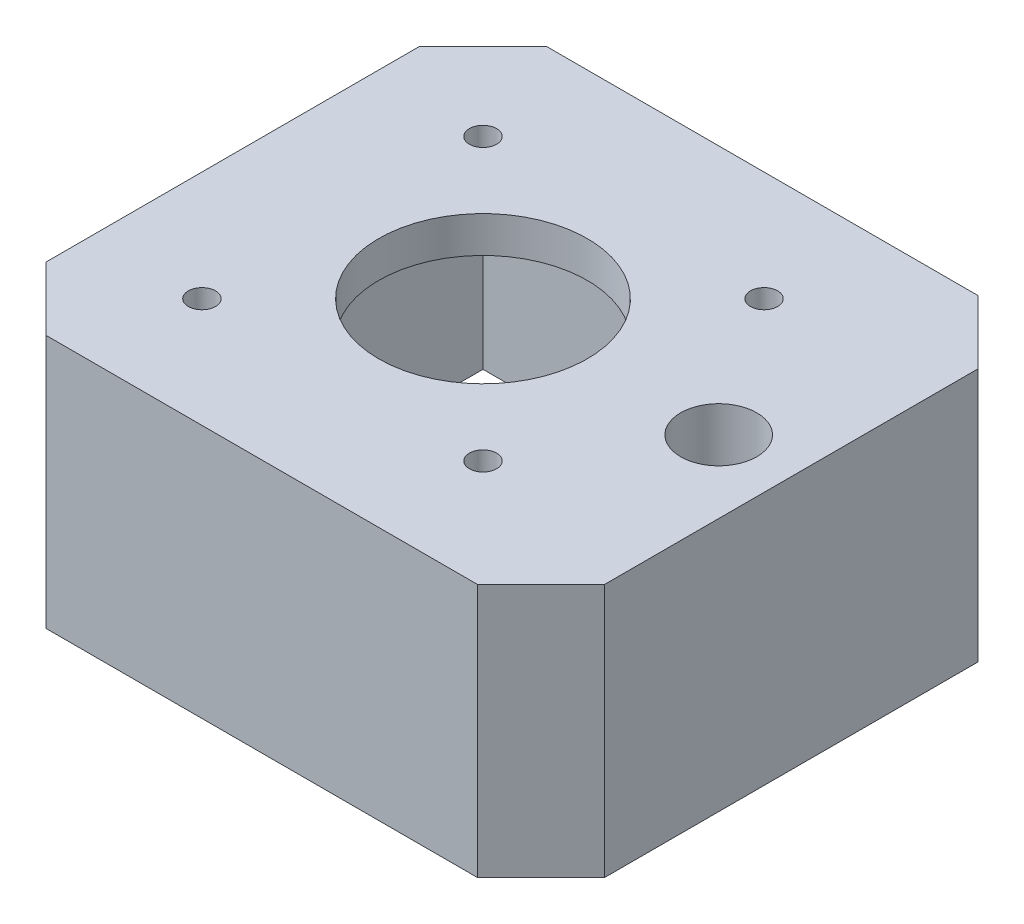
ISO-10303-21;
HEADER;
FILE_DESCRIPTION(('STEP AP214'),'2;1');
FILE_NAME('part.step','',(''),(''),'','','');
FILE_SCHEMA(('AUTOMOTIVE_DESIGN { 1 0 10303 214 1 1 1 1 }'));
ENDSEC;
DATA;
#1=APPLICATION_CONTEXT('core data for automotive mechanical design processes');
#2=APPLICATION_PROTOCOL_DEFINITION('international standard','automotive_design',2000,#1);
#3=PRODUCT_CONTEXT('',#1,'mechanical');
#4=PRODUCT('Part','Part','',(#3));
#5=PRODUCT_RELATED_PRODUCT_CATEGORY('part','',(#4));
#6=PRODUCT_DEFINITION_FORMATION('','',#4);
#7=PRODUCT_DEFINITION_CONTEXT('part definition',#1,'design');
#8=PRODUCT_DEFINITION('design','',#6,#7);
#9=PRODUCT_DEFINITION_SHAPE('','',#8);
#10=(LENGTH_UNIT() NAMED_UNIT(*) SI_UNIT(.MILLI.,.METRE.));
#11=(NAMED_UNIT(*) PLANE_ANGLE_UNIT() SI_UNIT($,.RADIAN.));
#12=(NAMED_UNIT(*) SI_UNIT($,.STERADIAN.) SOLID_ANGLE_UNIT());
#13=UNCERTAINTY_MEASURE_WITH_UNIT(LENGTH_MEASURE(1.E-05),#10,'distance_accuracy_value','');
#14=(GEOMETRIC_REPRESENTATION_CONTEXT(3) GLOBAL_UNCERTAINTY_ASSIGNED_CONTEXT((#13)) GLOBAL_UNIT_ASSIGNED_CONTEXT((#10,
#11,#12)) REPRESENTATION_CONTEXT('',''));
#15=CARTESIAN_POINT('',(0.,0.,0.));
#16=DIRECTION('',(0.,0.,1.));
#17=DIRECTION('',(1.,0.,0.));
#18=AXIS2_PLACEMENT_3D('',#15,#16,#17);
#19=CARTESIAN_POINT('',(0.,0.,0.));
#20=DIRECTION('',(0.,-1.,0.));
#21=DIRECTION('',(0.,0.,-1.));
#22=AXIS2_PLACEMENT_3D('',#19,#20,#21);
#23=PLANE('',#22);
#24=CARTESIAN_POINT('',(5.5,0.,-5.49999999999998));
#25=DIRECTION('',(0.,1.,0.));
#26=DIRECTION('',(0.,0.,-1.));
#27=AXIS2_PLACEMENT_3D('',#24,#25,#26);
#28=CIRCLE('',#27,1.5);
#29=CARTESIAN_POINT('',(5.5,0.,-6.99999999999999));
#30=VERTEX_POINT('',#29);
#31=EDGE_CURVE('E239',#30,#30,#28,.T.);
#32=ORIENTED_EDGE('',*,*,#31,.T.);
#33=EDGE_LOOP('',(#32));
#34=FACE_BOUND('',#33,.T.);
#35=CARTESIAN_POINT('',(5.5,0.,-36.5));
#36=DIRECTION('',(0.,1.,0.));
#37=DIRECTION('',(0.,0.,1.));
#38=AXIS2_PLACEMENT_3D('',#35,#36,#37);
#39=CIRCLE('',#38,1.5);
#40=CARTESIAN_POINT('',(5.5,0.,-35.));
#41=VERTEX_POINT('',#40);
#42=EDGE_CURVE('E251',#41,#41,#39,.T.);
#43=ORIENTED_EDGE('',*,*,#42,.T.);
#44=EDGE_LOOP('',(#43));
#45=FACE_BOUND('',#44,.T.);
#46=CARTESIAN_POINT('',(21.,0.,-21.));
#47=DIRECTION('',(0.,1.,0.));
#48=DIRECTION('',(0.,0.,1.));
#49=AXIS2_PLACEMENT_3D('',#46,#47,#48);
#50=CIRCLE('',#49,11.5);
#51=CARTESIAN_POINT('',(21.,0.,-9.5));
#52=VERTEX_POINT('',#51);
#53=EDGE_CURVE('E257',#52,#52,#50,.T.);
#54=ORIENTED_EDGE('',*,*,#53,.T.);
#55=EDGE_LOOP('',(#54));
#56=FACE_BOUND('',#55,.T.);
#57=CARTESIAN_POINT('',(36.5,0.,-36.5));
#58=DIRECTION('',(0.,1.,0.));
#59=DIRECTION('',(0.,0.,-1.));
#60=AXIS2_PLACEMENT_3D('',#57,#58,#59);
#61=CIRCLE('',#60,1.5);
#62=CARTESIAN_POINT('',(36.5,0.,-38.));
#63=VERTEX_POINT('',#62);
#64=EDGE_CURVE('E245',#63,#63,#61,.T.);
#65=ORIENTED_EDGE('',*,*,#64,.T.);
#66=EDGE_LOOP('',(#65));
#67=FACE_BOUND('',#66,.T.);
#68=CARTESIAN_POINT('',(36.5,0.,-5.49999999999998));
#69=DIRECTION('',(0.,1.,0.));
#70=DIRECTION('',(0.,0.,1.));
#71=AXIS2_PLACEMENT_3D('',#68,#69,#70);
#72=CIRCLE('',#71,1.5);
#73=CARTESIAN_POINT('',(36.5,0.,-3.99999999999998));
#74=VERTEX_POINT('',#73);
#75=EDGE_CURVE('E234',#74,#74,#72,.T.);
#76=ORIENTED_EDGE('',*,*,#75,.T.);
#77=EDGE_LOOP('',(#76));
#78=FACE_BOUND('',#77,.T.);
#79=DIRECTION('',(-1.,0.,0.));
#80=VECTOR('',#79,1.);
#81=CARTESIAN_POINT('',(42.25,0.,0.249999999999997));
#82=LINE('',#81,#80);
#83=CARTESIAN_POINT('',(42.25,0.,0.249999999999997));
#84=VERTEX_POINT('',#83);
#85=CARTESIAN_POINT('',(-0.25,0.,0.24999999999999));
#86=VERTEX_POINT('',#85);
#87=EDGE_CURVE('E210',#84,#86,#82,.T.);
#88=ORIENTED_EDGE('',*,*,#87,.T.);
#89=DIRECTION('',(0.,0.,-1.));
#90=VECTOR('',#89,1.);
#91=CARTESIAN_POINT('',(-0.25,0.,0.24999999999999));
#92=LINE('',#91,#90);
#93=CARTESIAN_POINT('',(-0.249999999999993,0.,-42.25));
#94=VERTEX_POINT('',#93);
#95=EDGE_CURVE('E207',#86,#94,#92,.T.);
#96=ORIENTED_EDGE('',*,*,#95,.T.);
#97=DIRECTION('',(-1.,0.,0.));
#98=VECTOR('',#97,1.);
#99=CARTESIAN_POINT('',(42.25,0.,-42.25));
#100=LINE('',#99,#98);
#101=CARTESIAN_POINT('',(42.25,0.,-42.25));
#102=VERTEX_POINT('',#101);
#103=EDGE_CURVE('E205',#102,#94,#100,.T.);
#104=ORIENTED_EDGE('',*,*,#103,.F.);
#105=DIRECTION('',(0.,0.,-1.));
#106=VECTOR('',#105,1.);
#107=CARTESIAN_POINT('',(42.25,0.,0.));
#108=LINE('',#107,#106);
#109=EDGE_CURVE('E230',#84,#102,#108,.T.);
#110=ORIENTED_EDGE('',*,*,#109,.F.);
#111=EDGE_LOOP('',(#88,#96,#104,#110));
#112=FACE_BOUND('',#111,.T.);
#113=ADVANCED_FACE('F58',(#34,#45,#56,#67,#78,#112),#23,.T.);
#114=CARTESIAN_POINT('',(0.,4.,0.));
#115=DIRECTION('',(0.,-1.,0.));
#116=DIRECTION('',(0.,0.,-1.));
#117=AXIS2_PLACEMENT_3D('',#114,#115,#116);
#118=PLANE('',#117);
#119=DIRECTION('',(0.,0.,-1.));
#120=VECTOR('',#119,1.);
#121=CARTESIAN_POINT('',(-6.6,4.,14.3175125526299));
#122=LINE('',#121,#120);
#123=CARTESIAN_POINT('',(-6.6,4.,-0.400000000000005));
#124=VERTEX_POINT('',#123);
#125=CARTESIAN_POINT('',(-6.6,4.,-41.6));
#126=VERTEX_POINT('',#125);
#127=EDGE_CURVE('E185',#124,#126,#122,.T.);
#128=ORIENTED_EDGE('',*,*,#127,.F.);
#129=DIRECTION('',(-0.707106781186548,0.,-0.707106781186547));
#130=VECTOR('',#129,1.);
#131=CARTESIAN_POINT('',(0.399999999999998,4.,6.59999999999999));
#132=LINE('',#131,#130);
#133=CARTESIAN_POINT('',(0.399999999999998,4.,6.59999999999999));
#134=VERTEX_POINT('',#133);
#135=EDGE_CURVE('E608',#134,#124,#132,.T.);
#136=ORIENTED_EDGE('',*,*,#135,.F.);
#137=DIRECTION('',(1.,0.,0.));
#138=VECTOR('',#137,1.);
#139=CARTESIAN_POINT('',(-7.7175125526299,4.,6.59999999999999));
#140=LINE('',#139,#138);
#141=CARTESIAN_POINT('',(48.,4.,6.6));
#142=VERTEX_POINT('',#141);
#143=EDGE_CURVE('E172',#134,#142,#140,.T.);
#144=ORIENTED_EDGE('',*,*,#143,.T.);
#145=DIRECTION('',(-0.707106781186548,0.,0.707106781186547));
#146=VECTOR('',#145,1.);
#147=CARTESIAN_POINT('',(55.,4.,-0.399999999999998));
#148=LINE('',#147,#146);
#149=CARTESIAN_POINT('',(55.,4.,-0.399999999999998));
#150=VERTEX_POINT('',#149);
#151=EDGE_CURVE('E73',#150,#142,#148,.T.);
#152=ORIENTED_EDGE('',*,*,#151,.F.);
#153=DIRECTION('',(0.,0.,-1.));
#154=VECTOR('',#153,1.);
#155=CARTESIAN_POINT('',(55.,4.,0.));
#156=LINE('',#155,#154);
#157=CARTESIAN_POINT('',(55.,4.,-41.6));
#158=VERTEX_POINT('',#157);
#159=EDGE_CURVE('E12',#150,#158,#156,.T.);
#160=ORIENTED_EDGE('',*,*,#159,.T.);
#161=DIRECTION('',(0.707106781186546,0.,0.707106781186549));
#162=VECTOR('',#161,1.);
#163=CARTESIAN_POINT('',(55.,4.,-41.6));
#164=LINE('',#163,#162);
#165=CARTESIAN_POINT('',(48.,4.,-48.6));
#166=VERTEX_POINT('',#165);
#167=EDGE_CURVE('E146',#166,#158,#164,.T.);
#168=ORIENTED_EDGE('',*,*,#167,.F.);
#169=DIRECTION('',(1.,0.,0.));
#170=VECTOR('',#169,1.);
#171=CARTESIAN_POINT('',(-7.7175125526299,4.,-48.6));
#172=LINE('',#171,#170);
#173=CARTESIAN_POINT('',(0.400000000000005,4.,-48.6));
#174=VERTEX_POINT('',#173);
#175=EDGE_CURVE('E189',#174,#166,#172,.T.);
#176=ORIENTED_EDGE('',*,*,#175,.F.);
#177=DIRECTION('',(0.707106781186548,0.,-0.707106781186547));
#178=VECTOR('',#177,1.);
#179=CARTESIAN_POINT('',(-6.6,4.,-41.6));
#180=LINE('',#179,#178);
#181=EDGE_CURVE('E600',#126,#174,#180,.T.);
#182=ORIENTED_EDGE('',*,*,#181,.F.);
#183=EDGE_LOOP('',(#128,#136,#144,#152,#160,#168,#176,#182));
#184=FACE_BOUND('',#183,.T.);
#185=CARTESIAN_POINT('',(47.,4.,-21.));
#186=DIRECTION('',(0.,1.,0.));
#187=DIRECTION('',(0.,0.,1.));
#188=AXIS2_PLACEMENT_3D('',#185,#186,#187);
#189=CIRCLE('',#188,4.2);
#190=CARTESIAN_POINT('',(47.,4.,-16.8));
#191=VERTEX_POINT('',#190);
#192=EDGE_CURVE('E66',#191,#191,#189,.T.);
#193=ORIENTED_EDGE('',*,*,#192,.F.);
#194=EDGE_LOOP('',(#193));
#195=FACE_BOUND('',#194,.T.);
#196=CARTESIAN_POINT('',(21.,4.,-21.));
#197=DIRECTION('',(0.,1.,0.));
#198=DIRECTION('',(0.,0.,1.));
#199=AXIS2_PLACEMENT_3D('',#196,#197,#198);
#200=CIRCLE('',#199,11.5);
#201=CARTESIAN_POINT('',(21.,4.,-9.5));
#202=VERTEX_POINT('',#201);
#203=EDGE_CURVE('E260',#202,#202,#200,.T.);
#204=ORIENTED_EDGE('',*,*,#203,.F.);
#205=EDGE_LOOP('',(#204));
#206=FACE_BOUND('',#205,.T.);
#207=CARTESIAN_POINT('',(5.5,4.,-36.5));
#208=DIRECTION('',(0.,1.,0.));
#209=DIRECTION('',(0.,0.,1.));
#210=AXIS2_PLACEMENT_3D('',#207,#208,#209);
#211=CIRCLE('',#210,1.5);
#212=CARTESIAN_POINT('',(5.5,4.,-35.));
#213=VERTEX_POINT('',#212);
#214=EDGE_CURVE('E254',#213,#213,#211,.T.);
#215=ORIENTED_EDGE('',*,*,#214,.F.);
#216=EDGE_LOOP('',(#215));
#217=FACE_BOUND('',#216,.T.);
#218=CARTESIAN_POINT('',(36.5,4.,-36.5));
#219=DIRECTION('',(0.,1.,0.));
#220=DIRECTION('',(0.,0.,-1.));
#221=AXIS2_PLACEMENT_3D('',#218,#219,#220);
#222=CIRCLE('',#221,1.5);
#223=CARTESIAN_POINT('',(36.5,4.,-38.));
#224=VERTEX_POINT('',#223);
#225=EDGE_CURVE('E248',#224,#224,#222,.T.);
#226=ORIENTED_EDGE('',*,*,#225,.F.);
#227=EDGE_LOOP('',(#226));
#228=FACE_BOUND('',#227,.T.);
#229=CARTESIAN_POINT('',(5.5,4.,-5.49999999999998));
#230=DIRECTION('',(0.,1.,0.));
#231=DIRECTION('',(0.,0.,-1.));
#232=AXIS2_PLACEMENT_3D('',#229,#230,#231);
#233=CIRCLE('',#232,1.5);
#234=CARTESIAN_POINT('',(5.5,4.,-6.99999999999999));
#235=VERTEX_POINT('',#234);
#236=EDGE_CURVE('E242',#235,#235,#233,.T.);
#237=ORIENTED_EDGE('',*,*,#236,.F.);
#238=EDGE_LOOP('',(#237));
#239=FACE_BOUND('',#238,.T.);
#240=CARTESIAN_POINT('',(36.5,4.,-5.49999999999998));
#241=DIRECTION('',(0.,1.,0.));
#242=DIRECTION('',(0.,0.,1.));
#243=AXIS2_PLACEMENT_3D('',#240,#241,#242);
#244=CIRCLE('',#243,1.5);
#245=CARTESIAN_POINT('',(36.5,4.,-3.99999999999998));
#246=VERTEX_POINT('',#245);
#247=EDGE_CURVE('E236',#246,#246,#244,.T.);
#248=ORIENTED_EDGE('',*,*,#247,.F.);
#249=EDGE_LOOP('',(#248));
#250=FACE_BOUND('',#249,.T.);
#251=ADVANCED_FACE('F167',(#184,#195,#206,#217,#228,#239,#250),#118,.F.);
#252=CARTESIAN_POINT('',(55.,4.,0.));
#253=DIRECTION('',(-1.,0.,0.));
#254=DIRECTION('',(0.,0.,1.));
#255=AXIS2_PLACEMENT_3D('',#252,#253,#254);
#256=PLANE('',#255);
#257=DIRECTION('',(0.,0.,1.));
#258=VECTOR('',#257,1.);
#259=CARTESIAN_POINT('',(55.,-24.,-31.));
#260=LINE('',#259,#258);
#261=CARTESIAN_POINT('',(55.,-24.,-41.6));
#262=VERTEX_POINT('',#261);
#263=CARTESIAN_POINT('',(55.,-24.,-0.399999999999998));
#264=VERTEX_POINT('',#263);
#265=EDGE_CURVE('E163',#262,#264,#260,.T.);
#266=ORIENTED_EDGE('',*,*,#265,.F.);
#267=DIRECTION('',(0.,1.,0.));
#268=VECTOR('',#267,1.);
#269=CARTESIAN_POINT('',(55.,-33.8994949366117,-41.6));
#270=LINE('',#269,#268);
#271=EDGE_CURVE('E149',#262,#158,#270,.T.);
#272=ORIENTED_EDGE('',*,*,#271,.T.);
#273=ORIENTED_EDGE('',*,*,#159,.F.);
#274=DIRECTION('',(0.,1.,0.));
#275=VECTOR('',#274,1.);
#276=CARTESIAN_POINT('',(55.,-33.8994949366117,-0.399999999999998));
#277=LINE('',#276,#275);
#278=EDGE_CURVE('E183',#264,#150,#277,.T.);
#279=ORIENTED_EDGE('',*,*,#278,.F.);
#280=EDGE_LOOP('',(#266,#272,#273,#279));
#281=FACE_BOUND('',#280,.T.);
#282=ADVANCED_FACE('F60',(#281),#256,.F.);
#283=CARTESIAN_POINT('',(47.,4.,-21.));
#284=DIRECTION('',(0.,-1.,0.));
#285=DIRECTION('',(0.,0.,-1.));
#286=AXIS2_PLACEMENT_3D('',#283,#284,#285);
#287=CYLINDRICAL_SURFACE('',#286,4.2);
#288=CARTESIAN_POINT('',(47.,-20.,-21.));
#289=DIRECTION('',(0.,-1.,0.));
#290=DIRECTION('',(0.,0.,-1.));
#291=AXIS2_PLACEMENT_3D('',#288,#289,#290);
#292=CIRCLE('',#291,4.2);
#293=CARTESIAN_POINT('',(47.,-20.,-25.2));
#294=VERTEX_POINT('',#293);
#295=EDGE_CURVE('E231',#294,#294,#292,.F.);
#296=ORIENTED_EDGE('',*,*,#295,.F.);
#297=EDGE_LOOP('',(#296));
#298=FACE_BOUND('',#297,.T.);
#299=ORIENTED_EDGE('',*,*,#192,.T.);
#300=EDGE_LOOP('',(#299));
#301=FACE_BOUND('',#300,.T.);
#302=ADVANCED_FACE('F267',(#298,#301),#287,.F.);
#303=CARTESIAN_POINT('',(21.,4.,-21.));
#304=DIRECTION('',(0.,-1.,0.));
#305=DIRECTION('',(0.,0.,-1.));
#306=AXIS2_PLACEMENT_3D('',#303,#304,#305);
#307=CYLINDRICAL_SURFACE('',#306,11.5);
#308=ORIENTED_EDGE('',*,*,#203,.T.);
#309=EDGE_LOOP('',(#308));
#310=FACE_BOUND('',#309,.T.);
#311=ORIENTED_EDGE('',*,*,#53,.F.);
#312=EDGE_LOOP('',(#311));
#313=FACE_BOUND('',#312,.T.);
#314=ADVANCED_FACE('F339',(#310,#313),#307,.F.);
#315=CARTESIAN_POINT('',(5.5,4.,-36.5));
#316=DIRECTION('',(0.,-1.,0.));
#317=DIRECTION('',(0.,0.,-1.));
#318=AXIS2_PLACEMENT_3D('',#315,#316,#317);
#319=CYLINDRICAL_SURFACE('',#318,1.5);
#320=ORIENTED_EDGE('',*,*,#214,.T.);
#321=EDGE_LOOP('',(#320));
#322=FACE_BOUND('',#321,.T.);
#323=ORIENTED_EDGE('',*,*,#42,.F.);
#324=EDGE_LOOP('',(#323));
#325=FACE_BOUND('',#324,.T.);
#326=ADVANCED_FACE('F335',(#322,#325),#319,.F.);
#327=CARTESIAN_POINT('',(36.5,4.,-36.5));
#328=DIRECTION('',(0.,-1.,0.));
#329=DIRECTION('',(0.,0.,-1.));
#330=AXIS2_PLACEMENT_3D('',#327,#328,#329);
#331=CYLINDRICAL_SURFACE('',#330,1.5);
#332=ORIENTED_EDGE('',*,*,#225,.T.);
#333=EDGE_LOOP('',(#332));
#334=FACE_BOUND('',#333,.T.);
#335=ORIENTED_EDGE('',*,*,#64,.F.);
#336=EDGE_LOOP('',(#335));
#337=FACE_BOUND('',#336,.T.);
#338=ADVANCED_FACE('F331',(#334,#337),#331,.F.);
#339=CARTESIAN_POINT('',(5.5,4.,-5.49999999999998));
#340=DIRECTION('',(0.,-1.,0.));
#341=DIRECTION('',(0.,0.,-1.));
#342=AXIS2_PLACEMENT_3D('',#339,#340,#341);
#343=CYLINDRICAL_SURFACE('',#342,1.5);
#344=ORIENTED_EDGE('',*,*,#236,.T.);
#345=EDGE_LOOP('',(#344));
#346=FACE_BOUND('',#345,.T.);
#347=ORIENTED_EDGE('',*,*,#31,.F.);
#348=EDGE_LOOP('',(#347));
#349=FACE_BOUND('',#348,.T.);
#350=ADVANCED_FACE('F285',(#346,#349),#343,.F.);
#351=CARTESIAN_POINT('',(36.5,4.,-5.49999999999998));
#352=DIRECTION('',(0.,-1.,0.));
#353=DIRECTION('',(0.,0.,-1.));
#354=AXIS2_PLACEMENT_3D('',#351,#352,#353);
#355=CYLINDRICAL_SURFACE('',#354,1.5);
#356=ORIENTED_EDGE('',*,*,#247,.T.);
#357=EDGE_LOOP('',(#356));
#358=FACE_BOUND('',#357,.T.);
#359=ORIENTED_EDGE('',*,*,#75,.F.);
#360=EDGE_LOOP('',(#359));
#361=FACE_BOUND('',#360,.T.);
#362=ADVANCED_FACE('F281',(#358,#361),#355,.F.);
#363=CARTESIAN_POINT('',(42.25,-20.,0.));
#364=DIRECTION('',(1.,0.,0.));
#365=DIRECTION('',(0.,0.,-1.));
#366=AXIS2_PLACEMENT_3D('',#363,#364,#365);
#367=PLANE('',#366);
#368=ORIENTED_EDGE('',*,*,#109,.T.);
#369=DIRECTION('',(0.,1.,0.));
#370=VECTOR('',#369,1.);
#371=CARTESIAN_POINT('',(42.25,-102.064588642995,-42.25));
#372=LINE('',#371,#370);
#373=CARTESIAN_POINT('',(42.25,-24.,-42.25));
#374=VERTEX_POINT('',#373);
#375=EDGE_CURVE('E213',#374,#102,#372,.T.);
#376=ORIENTED_EDGE('',*,*,#375,.F.);
#377=DIRECTION('',(0.,0.,-1.));
#378=VECTOR('',#377,1.);
#379=CARTESIAN_POINT('',(42.25,-24.,-31.));
#380=LINE('',#379,#378);
#381=CARTESIAN_POINT('',(42.25,-24.,0.249999999999997));
#382=VERTEX_POINT('',#381);
#383=EDGE_CURVE('E228',#382,#374,#380,.T.);
#384=ORIENTED_EDGE('',*,*,#383,.F.);
#385=DIRECTION('',(0.,1.,0.));
#386=VECTOR('',#385,1.);
#387=CARTESIAN_POINT('',(42.25,-102.064588642995,0.249999999999997));
#388=LINE('',#387,#386);
#389=EDGE_CURVE('E217',#382,#84,#388,.T.);
#390=ORIENTED_EDGE('',*,*,#389,.T.);
#391=EDGE_LOOP('',(#368,#376,#384,#390));
#392=FACE_BOUND('',#391,.T.);
#393=ADVANCED_FACE('F284',(#392),#367,.F.);
#394=CARTESIAN_POINT('',(0.,-20.,0.));
#395=DIRECTION('',(0.,-1.,0.));
#396=DIRECTION('',(0.,0.,-1.));
#397=AXIS2_PLACEMENT_3D('',#394,#395,#396);
#398=PLANE('',#397);
#399=ORIENTED_EDGE('',*,*,#295,.T.);
#400=EDGE_LOOP('',(#399));
#401=FACE_BOUND('',#400,.T.);
#402=ADVANCED_FACE('F312',(#401),#398,.F.);
#403=CARTESIAN_POINT('',(0.,-24.,0.));
#404=DIRECTION('',(0.,-1.,0.));
#405=DIRECTION('',(0.,0.,-1.));
#406=AXIS2_PLACEMENT_3D('',#403,#404,#405);
#407=PLANE('',#406);
#408=DIRECTION('',(-0.707106781186548,0.,-0.707106781186547));
#409=VECTOR('',#408,1.);
#410=CARTESIAN_POINT('',(0.399999999999998,-24.,6.59999999999999));
#411=LINE('',#410,#409);
#412=CARTESIAN_POINT('',(0.399999999999998,-24.,6.6));
#413=VERTEX_POINT('',#412);
#414=CARTESIAN_POINT('',(-6.6,-24.,-0.400000000000005));
#415=VERTEX_POINT('',#414);
#416=EDGE_CURVE('E81',#413,#415,#411,.T.);
#417=ORIENTED_EDGE('',*,*,#416,.T.);
#418=DIRECTION('',(0.,0.,-1.));
#419=VECTOR('',#418,1.);
#420=CARTESIAN_POINT('',(-6.6,-24.,6.59999999999999));
#421=LINE('',#420,#419);
#422=CARTESIAN_POINT('',(-6.6,-24.,-41.6));
#423=VERTEX_POINT('',#422);
#424=EDGE_CURVE('E196',#415,#423,#421,.T.);
#425=ORIENTED_EDGE('',*,*,#424,.T.);
#426=DIRECTION('',(0.707106781186548,0.,-0.707106781186547));
#427=VECTOR('',#426,1.);
#428=CARTESIAN_POINT('',(-6.6,-24.,-41.6));
#429=LINE('',#428,#427);
#430=CARTESIAN_POINT('',(0.400000000000005,-24.,-48.6));
#431=VERTEX_POINT('',#430);
#432=EDGE_CURVE('E603',#423,#431,#429,.T.);
#433=ORIENTED_EDGE('',*,*,#432,.T.);
#434=DIRECTION('',(-1.,0.,0.));
#435=VECTOR('',#434,1.);
#436=CARTESIAN_POINT('',(48.6,-24.,-48.6));
#437=LINE('',#436,#435);
#438=CARTESIAN_POINT('',(48.,-24.,-48.6));
#439=VERTEX_POINT('',#438);
#440=EDGE_CURVE('E202',#439,#431,#437,.T.);
#441=ORIENTED_EDGE('',*,*,#440,.F.);
#442=DIRECTION('',(0.707106781186546,0.,0.707106781186549));
#443=VECTOR('',#442,1.);
#444=CARTESIAN_POINT('',(55.,-24.,-41.6));
#445=LINE('',#444,#443);
#446=EDGE_CURVE('E164',#439,#262,#445,.T.);
#447=ORIENTED_EDGE('',*,*,#446,.T.);
#448=ORIENTED_EDGE('',*,*,#265,.T.);
#449=DIRECTION('',(-0.707106781186548,0.,0.707106781186547));
#450=VECTOR('',#449,1.);
#451=CARTESIAN_POINT('',(55.,-24.,-0.399999999999998));
#452=LINE('',#451,#450);
#453=CARTESIAN_POINT('',(48.,-24.,6.59999999999999));
#454=VERTEX_POINT('',#453);
#455=EDGE_CURVE('E173',#264,#454,#452,.T.);
#456=ORIENTED_EDGE('',*,*,#455,.T.);
#457=DIRECTION('',(-1.,0.,0.));
#458=VECTOR('',#457,1.);
#459=CARTESIAN_POINT('',(48.6,-24.,6.6));
#460=LINE('',#459,#458);
#461=EDGE_CURVE('E199',#454,#413,#460,.T.);
#462=ORIENTED_EDGE('',*,*,#461,.T.);
#463=EDGE_LOOP('',(#417,#425,#433,#441,#447,#448,#456,#462));
#464=FACE_BOUND('',#463,.T.);
#465=ORIENTED_EDGE('',*,*,#383,.T.);
#466=DIRECTION('',(-1.,0.,0.));
#467=VECTOR('',#466,1.);
#468=CARTESIAN_POINT('',(42.25,-24.,-42.25));
#469=LINE('',#468,#467);
#470=CARTESIAN_POINT('',(-0.249999999999993,-24.,-42.25));
#471=VERTEX_POINT('',#470);
#472=EDGE_CURVE('E194',#374,#471,#469,.T.);
#473=ORIENTED_EDGE('',*,*,#472,.T.);
#474=DIRECTION('',(0.,0.,-1.));
#475=VECTOR('',#474,1.);
#476=CARTESIAN_POINT('',(-0.25,-24.,0.24999999999999));
#477=LINE('',#476,#475);
#478=CARTESIAN_POINT('',(-0.25,-24.,0.24999999999999));
#479=VERTEX_POINT('',#478);
#480=EDGE_CURVE('E216',#479,#471,#477,.T.);
#481=ORIENTED_EDGE('',*,*,#480,.F.);
#482=DIRECTION('',(-1.,0.,0.));
#483=VECTOR('',#482,1.);
#484=CARTESIAN_POINT('',(42.25,-24.,0.249999999999997));
#485=LINE('',#484,#483);
#486=EDGE_CURVE('E191',#382,#479,#485,.T.);
#487=ORIENTED_EDGE('',*,*,#486,.F.);
#488=EDGE_LOOP('',(#465,#473,#481,#487));
#489=FACE_BOUND('',#488,.T.);
#490=ADVANCED_FACE('F309',(#464,#489),#407,.T.);
#491=CARTESIAN_POINT('',(-6.6,-102.064588642995,6.59999999999999));
#492=DIRECTION('',(1.,0.,0.));
#493=DIRECTION('',(0.,0.,-1.));
#494=AXIS2_PLACEMENT_3D('',#491,#492,#493);
#495=PLANE('',#494);
#496=ORIENTED_EDGE('',*,*,#424,.F.);
#497=DIRECTION('',(0.,1.,0.));
#498=VECTOR('',#497,1.);
#499=CARTESIAN_POINT('',(-6.6,-33.8994949366117,-0.400000000000005));
#500=LINE('',#499,#498);
#501=EDGE_CURVE('E610',#415,#124,#500,.T.);
#502=ORIENTED_EDGE('',*,*,#501,.T.);
#503=ORIENTED_EDGE('',*,*,#127,.T.);
#504=DIRECTION('',(0.,1.,0.));
#505=VECTOR('',#504,1.);
#506=CARTESIAN_POINT('',(-6.6,-33.8994949366117,-41.6));
#507=LINE('',#506,#505);
#508=EDGE_CURVE('E602',#423,#126,#507,.T.);
#509=ORIENTED_EDGE('',*,*,#508,.F.);
#510=EDGE_LOOP('',(#496,#502,#503,#509));
#511=FACE_BOUND('',#510,.T.);
#512=ADVANCED_FACE('F311',(#511),#495,.F.);
#513=CARTESIAN_POINT('',(48.6,-102.064588642995,6.6));
#514=DIRECTION('',(0.,0.,-1.));
#515=DIRECTION('',(-1.,0.,0.));
#516=AXIS2_PLACEMENT_3D('',#513,#514,#515);
#517=PLANE('',#516);
#518=ORIENTED_EDGE('',*,*,#143,.F.);
#519=DIRECTION('',(0.,1.,0.));
#520=VECTOR('',#519,1.);
#521=CARTESIAN_POINT('',(0.399999999999998,-33.8994949366117,6.59999999999999));
#522=LINE('',#521,#520);
#523=EDGE_CURVE('E179',#413,#134,#522,.T.);
#524=ORIENTED_EDGE('',*,*,#523,.F.);
#525=ORIENTED_EDGE('',*,*,#461,.F.);
#526=DIRECTION('',(0.,1.,0.));
#527=VECTOR('',#526,1.);
#528=CARTESIAN_POINT('',(48.,-33.8994949366117,6.59999999999999));
#529=LINE('',#528,#527);
#530=EDGE_CURVE('E176',#454,#142,#529,.T.);
#531=ORIENTED_EDGE('',*,*,#530,.T.);
#532=EDGE_LOOP('',(#518,#524,#525,#531));
#533=FACE_BOUND('',#532,.T.);
#534=ADVANCED_FACE('F319',(#533),#517,.F.);
#535=CARTESIAN_POINT('',(48.6,-102.064588642995,-48.6));
#536=DIRECTION('',(0.,0.,-1.));
#537=DIRECTION('',(-1.,0.,0.));
#538=AXIS2_PLACEMENT_3D('',#535,#536,#537);
#539=PLANE('',#538);
#540=DIRECTION('',(0.,1.,0.));
#541=VECTOR('',#540,1.);
#542=CARTESIAN_POINT('',(0.400000000000005,-33.8994949366117,-48.6));
#543=LINE('',#542,#541);
#544=EDGE_CURVE('E156',#431,#174,#543,.T.);
#545=ORIENTED_EDGE('',*,*,#544,.T.);
#546=ORIENTED_EDGE('',*,*,#175,.T.);
#547=DIRECTION('',(0.,1.,0.));
#548=VECTOR('',#547,1.);
#549=CARTESIAN_POINT('',(48.,-33.8994949366117,-48.6));
#550=LINE('',#549,#548);
#551=EDGE_CURVE('E152',#439,#166,#550,.T.);
#552=ORIENTED_EDGE('',*,*,#551,.F.);
#553=ORIENTED_EDGE('',*,*,#440,.T.);
#554=EDGE_LOOP('',(#545,#546,#552,#553));
#555=FACE_BOUND('',#554,.T.);
#556=ADVANCED_FACE('F325',(#555),#539,.T.);
#557=CARTESIAN_POINT('',(-0.25,-102.064588642995,0.24999999999999));
#558=DIRECTION('',(1.,0.,0.));
#559=DIRECTION('',(0.,0.,-1.));
#560=AXIS2_PLACEMENT_3D('',#557,#558,#559);
#561=PLANE('',#560);
#562=DIRECTION('',(0.,1.,0.));
#563=VECTOR('',#562,1.);
#564=CARTESIAN_POINT('',(-0.25,-102.064588642995,0.24999999999999));
#565=LINE('',#564,#563);
#566=EDGE_CURVE('E220',#479,#86,#565,.T.);
#567=ORIENTED_EDGE('',*,*,#566,.F.);
#568=ORIENTED_EDGE('',*,*,#480,.T.);
#569=DIRECTION('',(0.,1.,0.));
#570=VECTOR('',#569,1.);
#571=CARTESIAN_POINT('',(-0.249999999999993,-102.064588642995,-42.25));
#572=LINE('',#571,#570);
#573=EDGE_CURVE('E212',#471,#94,#572,.T.);
#574=ORIENTED_EDGE('',*,*,#573,.T.);
#575=ORIENTED_EDGE('',*,*,#95,.F.);
#576=EDGE_LOOP('',(#567,#568,#574,#575));
#577=FACE_BOUND('',#576,.T.);
#578=ADVANCED_FACE('F301',(#577),#561,.T.);
#579=CARTESIAN_POINT('',(42.25,-102.064588642995,0.249999999999997));
#580=DIRECTION('',(0.,0.,-1.));
#581=DIRECTION('',(-1.,0.,0.));
#582=AXIS2_PLACEMENT_3D('',#579,#580,#581);
#583=PLANE('',#582);
#584=ORIENTED_EDGE('',*,*,#389,.F.);
#585=ORIENTED_EDGE('',*,*,#486,.T.);
#586=ORIENTED_EDGE('',*,*,#566,.T.);
#587=ORIENTED_EDGE('',*,*,#87,.F.);
#588=EDGE_LOOP('',(#584,#585,#586,#587));
#589=FACE_BOUND('',#588,.T.);
#590=ADVANCED_FACE('F298',(#589),#583,.T.);
#591=CARTESIAN_POINT('',(42.25,-102.064588642995,-42.25));
#592=DIRECTION('',(0.,0.,-1.));
#593=DIRECTION('',(-1.,0.,0.));
#594=AXIS2_PLACEMENT_3D('',#591,#592,#593);
#595=PLANE('',#594);
#596=ORIENTED_EDGE('',*,*,#472,.F.);
#597=ORIENTED_EDGE('',*,*,#375,.T.);
#598=ORIENTED_EDGE('',*,*,#103,.T.);
#599=ORIENTED_EDGE('',*,*,#573,.F.);
#600=EDGE_LOOP('',(#596,#597,#598,#599));
#601=FACE_BOUND('',#600,.T.);
#602=ADVANCED_FACE('F305',(#601),#595,.F.);
#603=CARTESIAN_POINT('',(55.,-33.8994949366117,-41.6));
#604=DIRECTION('',(-0.707106781186549,0.,0.707106781186546));
#605=DIRECTION('',(0.707106781186546,0.,0.707106781186549));
#606=AXIS2_PLACEMENT_3D('',#603,#604,#605);
#607=PLANE('',#606);
#608=ORIENTED_EDGE('',*,*,#551,.T.);
#609=ORIENTED_EDGE('',*,*,#167,.T.);
#610=ORIENTED_EDGE('',*,*,#271,.F.);
#611=ORIENTED_EDGE('',*,*,#446,.F.);
#612=EDGE_LOOP('',(#608,#609,#610,#611));
#613=FACE_BOUND('',#612,.T.);
#614=ADVANCED_FACE('F148',(#613),#607,.F.);
#615=CARTESIAN_POINT('',(-6.6,-33.8994949366117,-41.6));
#616=DIRECTION('',(0.707106781186547,0.,0.707106781186548));
#617=DIRECTION('',(0.707106781186548,0.,-0.707106781186547));
#618=AXIS2_PLACEMENT_3D('',#615,#616,#617);
#619=PLANE('',#618);
#620=ORIENTED_EDGE('',*,*,#508,.T.);
#621=ORIENTED_EDGE('',*,*,#181,.T.);
#622=ORIENTED_EDGE('',*,*,#544,.F.);
#623=ORIENTED_EDGE('',*,*,#432,.F.);
#624=EDGE_LOOP('',(#620,#621,#622,#623));
#625=FACE_BOUND('',#624,.T.);
#626=ADVANCED_FACE('F402',(#625),#619,.F.);
#627=CARTESIAN_POINT('',(55.,-33.8994949366117,-0.399999999999998));
#628=DIRECTION('',(-0.707106781186547,0.,-0.707106781186548));
#629=DIRECTION('',(-0.707106781186548,0.,0.707106781186547));
#630=AXIS2_PLACEMENT_3D('',#627,#628,#629);
#631=PLANE('',#630);
#632=ORIENTED_EDGE('',*,*,#278,.T.);
#633=ORIENTED_EDGE('',*,*,#151,.T.);
#634=ORIENTED_EDGE('',*,*,#530,.F.);
#635=ORIENTED_EDGE('',*,*,#455,.F.);
#636=EDGE_LOOP('',(#632,#633,#634,#635));
#637=FACE_BOUND('',#636,.T.);
#638=ADVANCED_FACE('F410',(#637),#631,.F.);
#639=CARTESIAN_POINT('',(0.399999999999998,-33.8994949366117,6.59999999999999));
#640=DIRECTION('',(0.707106781186547,0.,-0.707106781186548));
#641=DIRECTION('',(-0.707106781186548,0.,-0.707106781186547));
#642=AXIS2_PLACEMENT_3D('',#639,#640,#641);
#643=PLANE('',#642);
#644=ORIENTED_EDGE('',*,*,#523,.T.);
#645=ORIENTED_EDGE('',*,*,#135,.T.);
#646=ORIENTED_EDGE('',*,*,#501,.F.);
#647=ORIENTED_EDGE('',*,*,#416,.F.);
#648=EDGE_LOOP('',(#644,#645,#646,#647));
#649=FACE_BOUND('',#648,.T.);
#650=ADVANCED_FACE('F418',(#649),#643,.F.);
#651=CLOSED_SHELL('',(#113,#251,#282,#302,#314,#326,#338,#350,#362,#393,#402,#490,#512,#534,
#556,#578,#590,#602,#614,#626,#638,#650));
#652=MANIFOLD_SOLID_BREP('B2',#651);
#653=ADVANCED_BREP_SHAPE_REPRESENTATION('',(#18,#652),#14);
#654=SHAPE_DEFINITION_REPRESENTATION(#9,#653);
ENDSEC;
END-ISO-10303-21;
